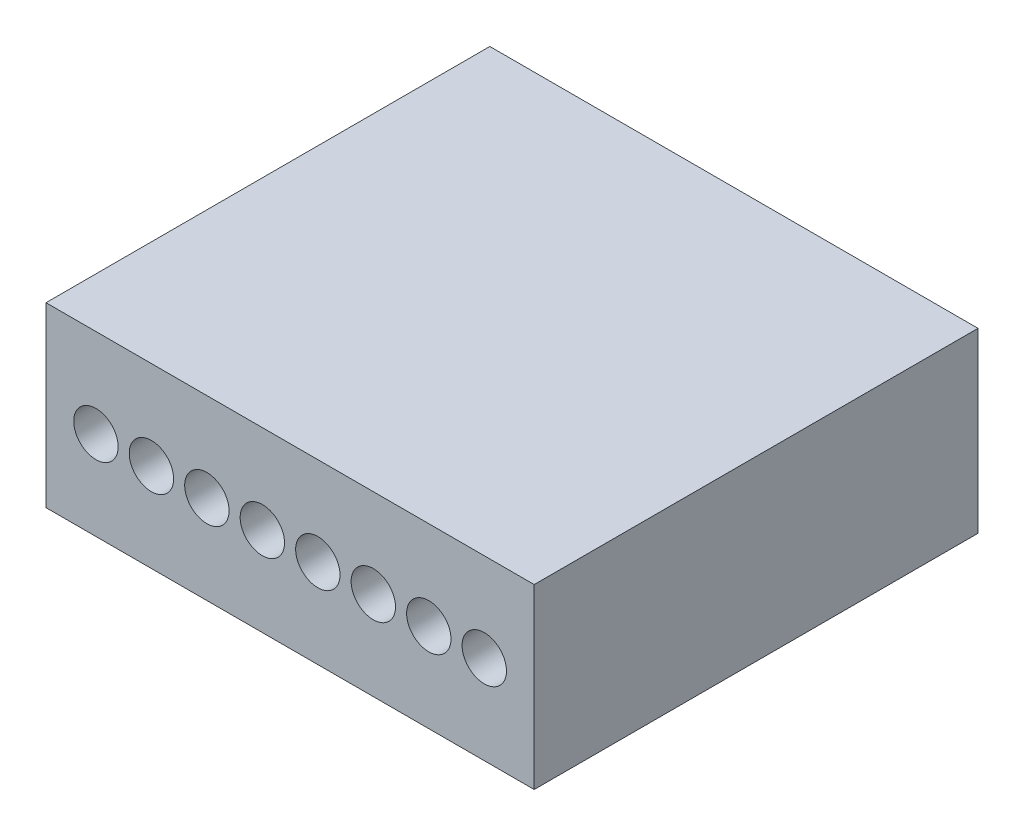
ISO-10303-21;
HEADER;
FILE_DESCRIPTION(('STEP AP214'),'2;1');
FILE_NAME('part.step','',(''),(''),'','','');
FILE_SCHEMA(('AUTOMOTIVE_DESIGN { 1 0 10303 214 1 1 1 1 }'));
ENDSEC;
DATA;
#1=APPLICATION_CONTEXT('core data for automotive mechanical design processes');
#2=APPLICATION_PROTOCOL_DEFINITION('international standard','automotive_design',2000,#1);
#3=PRODUCT_CONTEXT('',#1,'mechanical');
#4=PRODUCT('Part','Part','',(#3));
#5=PRODUCT_RELATED_PRODUCT_CATEGORY('part','',(#4));
#6=PRODUCT_DEFINITION_FORMATION('','',#4);
#7=PRODUCT_DEFINITION_CONTEXT('part definition',#1,'design');
#8=PRODUCT_DEFINITION('design','',#6,#7);
#9=PRODUCT_DEFINITION_SHAPE('','',#8);
#10=(LENGTH_UNIT() NAMED_UNIT(*) SI_UNIT(.MILLI.,.METRE.));
#11=(NAMED_UNIT(*) PLANE_ANGLE_UNIT() SI_UNIT($,.RADIAN.));
#12=(NAMED_UNIT(*) SI_UNIT($,.STERADIAN.) SOLID_ANGLE_UNIT());
#13=UNCERTAINTY_MEASURE_WITH_UNIT(LENGTH_MEASURE(1.E-05),#10,'distance_accuracy_value','');
#14=(GEOMETRIC_REPRESENTATION_CONTEXT(3) GLOBAL_UNCERTAINTY_ASSIGNED_CONTEXT((#13)) GLOBAL_UNIT_ASSIGNED_CONTEXT((#10,
#11,#12)) REPRESENTATION_CONTEXT('',''));
#15=CARTESIAN_POINT('',(0.,0.,0.));
#16=DIRECTION('',(0.,0.,1.));
#17=DIRECTION('',(1.,0.,0.));
#18=AXIS2_PLACEMENT_3D('',#15,#16,#17);
#19=CARTESIAN_POINT('',(0.,0.,10.));
#20=DIRECTION('',(1.,0.,0.));
#21=DIRECTION('',(0.,0.,-1.));
#22=AXIS2_PLACEMENT_3D('',#19,#20,#21);
#23=PLANE('',#22);
#24=DIRECTION('',(0.,-1.,0.));
#25=VECTOR('',#24,1.);
#26=CARTESIAN_POINT('',(0.,0.,0.));
#27=LINE('',#26,#25);
#28=CARTESIAN_POINT('',(0.,4.,0.));
#29=VERTEX_POINT('',#28);
#30=CARTESIAN_POINT('',(0.,0.,0.));
#31=VERTEX_POINT('',#30);
#32=EDGE_CURVE('E107',#29,#31,#27,.T.);
#33=ORIENTED_EDGE('',*,*,#32,.T.);
#34=DIRECTION('',(0.,0.,-1.));
#35=VECTOR('',#34,1.);
#36=CARTESIAN_POINT('',(0.,0.,10.));
#37=LINE('',#36,#35);
#38=CARTESIAN_POINT('',(0.,0.,10.));
#39=VERTEX_POINT('',#38);
#40=EDGE_CURVE('E11',#39,#31,#37,.T.);
#41=ORIENTED_EDGE('',*,*,#40,.F.);
#42=DIRECTION('',(0.,-1.,0.));
#43=VECTOR('',#42,1.);
#44=CARTESIAN_POINT('',(0.,0.,10.));
#45=LINE('',#44,#43);
#46=CARTESIAN_POINT('',(0.,4.,10.));
#47=VERTEX_POINT('',#46);
#48=EDGE_CURVE('E91',#47,#39,#45,.T.);
#49=ORIENTED_EDGE('',*,*,#48,.F.);
#50=DIRECTION('',(0.,0.,-1.));
#51=VECTOR('',#50,1.);
#52=CARTESIAN_POINT('',(0.,4.,10.));
#53=LINE('',#52,#51);
#54=EDGE_CURVE('E103',#47,#29,#53,.T.);
#55=ORIENTED_EDGE('',*,*,#54,.T.);
#56=EDGE_LOOP('',(#33,#41,#49,#55));
#57=FACE_BOUND('',#56,.T.);
#58=ADVANCED_FACE('F39',(#57),#23,.F.);
#59=CARTESIAN_POINT('',(0.,0.,10.));
#60=DIRECTION('',(0.,1.,0.));
#61=DIRECTION('',(0.,0.,1.));
#62=AXIS2_PLACEMENT_3D('',#59,#60,#61);
#63=PLANE('',#62);
#64=DIRECTION('',(1.,0.,0.));
#65=VECTOR('',#64,1.);
#66=CARTESIAN_POINT('',(0.,0.,0.));
#67=LINE('',#66,#65);
#68=CARTESIAN_POINT('',(11.,0.,0.));
#69=VERTEX_POINT('',#68);
#70=EDGE_CURVE('E96',#31,#69,#67,.T.);
#71=ORIENTED_EDGE('',*,*,#70,.T.);
#72=DIRECTION('',(0.,0.,-1.));
#73=VECTOR('',#72,1.);
#74=CARTESIAN_POINT('',(11.,0.,10.));
#75=LINE('',#74,#73);
#76=CARTESIAN_POINT('',(11.,0.,10.));
#77=VERTEX_POINT('',#76);
#78=EDGE_CURVE('E48',#77,#69,#75,.T.);
#79=ORIENTED_EDGE('',*,*,#78,.F.);
#80=DIRECTION('',(1.,0.,0.));
#81=VECTOR('',#80,1.);
#82=CARTESIAN_POINT('',(0.,0.,10.));
#83=LINE('',#82,#81);
#84=EDGE_CURVE('E86',#39,#77,#83,.T.);
#85=ORIENTED_EDGE('',*,*,#84,.F.);
#86=ORIENTED_EDGE('',*,*,#40,.T.);
#87=EDGE_LOOP('',(#71,#79,#85,#86));
#88=FACE_BOUND('',#87,.T.);
#89=ADVANCED_FACE('F95',(#88),#63,.F.);
#90=CARTESIAN_POINT('',(11.,0.,10.));
#91=DIRECTION('',(-1.,0.,0.));
#92=DIRECTION('',(0.,0.,1.));
#93=AXIS2_PLACEMENT_3D('',#90,#91,#92);
#94=PLANE('',#93);
#95=DIRECTION('',(0.,1.,0.));
#96=VECTOR('',#95,1.);
#97=CARTESIAN_POINT('',(11.,0.,0.));
#98=LINE('',#97,#96);
#99=CARTESIAN_POINT('',(11.,4.,0.));
#100=VERTEX_POINT('',#99);
#101=EDGE_CURVE('E73',#69,#100,#98,.T.);
#102=ORIENTED_EDGE('',*,*,#101,.T.);
#103=DIRECTION('',(0.,0.,-1.));
#104=VECTOR('',#103,1.);
#105=CARTESIAN_POINT('',(11.,4.,10.));
#106=LINE('',#105,#104);
#107=CARTESIAN_POINT('',(11.,4.,10.));
#108=VERTEX_POINT('',#107);
#109=EDGE_CURVE('E98',#108,#100,#106,.T.);
#110=ORIENTED_EDGE('',*,*,#109,.F.);
#111=DIRECTION('',(0.,1.,0.));
#112=VECTOR('',#111,1.);
#113=CARTESIAN_POINT('',(11.,0.,10.));
#114=LINE('',#113,#112);
#115=EDGE_CURVE('E89',#77,#108,#114,.T.);
#116=ORIENTED_EDGE('',*,*,#115,.F.);
#117=ORIENTED_EDGE('',*,*,#78,.T.);
#118=EDGE_LOOP('',(#102,#110,#116,#117));
#119=FACE_BOUND('',#118,.T.);
#120=ADVANCED_FACE('F99',(#119),#94,.F.);
#121=CARTESIAN_POINT('',(0.,4.,10.));
#122=DIRECTION('',(0.,-1.,0.));
#123=DIRECTION('',(0.,0.,-1.));
#124=AXIS2_PLACEMENT_3D('',#121,#122,#123);
#125=PLANE('',#124);
#126=DIRECTION('',(-1.,0.,0.));
#127=VECTOR('',#126,1.);
#128=CARTESIAN_POINT('',(0.,4.,0.));
#129=LINE('',#128,#127);
#130=EDGE_CURVE('E79',#100,#29,#129,.T.);
#131=ORIENTED_EDGE('',*,*,#130,.T.);
#132=ORIENTED_EDGE('',*,*,#54,.F.);
#133=DIRECTION('',(-1.,0.,0.));
#134=VECTOR('',#133,1.);
#135=CARTESIAN_POINT('',(0.,4.,10.));
#136=LINE('',#135,#134);
#137=EDGE_CURVE('E56',#108,#47,#136,.T.);
#138=ORIENTED_EDGE('',*,*,#137,.F.);
#139=ORIENTED_EDGE('',*,*,#109,.T.);
#140=EDGE_LOOP('',(#131,#132,#138,#139));
#141=FACE_BOUND('',#140,.T.);
#142=ADVANCED_FACE('F121',(#141),#125,.F.);
#143=CARTESIAN_POINT('',(0.,0.,10.));
#144=DIRECTION('',(0.,0.,-1.));
#145=DIRECTION('',(-1.,0.,0.));
#146=AXIS2_PLACEMENT_3D('',#143,#144,#145);
#147=PLANE('',#146);
#148=CARTESIAN_POINT('',(1.125,2.,10.));
#149=DIRECTION('',(0.,0.,1.));
#150=DIRECTION('',(1.,0.,0.));
#151=AXIS2_PLACEMENT_3D('',#148,#149,#150);
#152=CIRCLE('',#151,0.5);
#153=CARTESIAN_POINT('',(1.625,2.,10.));
#154=VERTEX_POINT('',#153);
#155=EDGE_CURVE('E184',#154,#154,#152,.T.);
#156=ORIENTED_EDGE('',*,*,#155,.F.);
#157=EDGE_LOOP('',(#156));
#158=FACE_BOUND('',#157,.T.);
#159=CARTESIAN_POINT('',(2.375,2.,10.));
#160=DIRECTION('',(0.,0.,1.));
#161=DIRECTION('',(1.,0.,0.));
#162=AXIS2_PLACEMENT_3D('',#159,#160,#161);
#163=CIRCLE('',#162,0.5);
#164=CARTESIAN_POINT('',(2.875,2.,10.));
#165=VERTEX_POINT('',#164);
#166=EDGE_CURVE('E176',#165,#165,#163,.T.);
#167=ORIENTED_EDGE('',*,*,#166,.F.);
#168=EDGE_LOOP('',(#167));
#169=FACE_BOUND('',#168,.T.);
#170=CARTESIAN_POINT('',(3.625,2.,10.));
#171=DIRECTION('',(0.,0.,1.));
#172=DIRECTION('',(1.,0.,0.));
#173=AXIS2_PLACEMENT_3D('',#170,#171,#172);
#174=CIRCLE('',#173,0.5);
#175=CARTESIAN_POINT('',(4.125,2.,10.));
#176=VERTEX_POINT('',#175);
#177=EDGE_CURVE('E168',#176,#176,#174,.T.);
#178=ORIENTED_EDGE('',*,*,#177,.F.);
#179=EDGE_LOOP('',(#178));
#180=FACE_BOUND('',#179,.T.);
#181=CARTESIAN_POINT('',(4.875,2.,10.));
#182=DIRECTION('',(0.,0.,1.));
#183=DIRECTION('',(1.,0.,0.));
#184=AXIS2_PLACEMENT_3D('',#181,#182,#183);
#185=CIRCLE('',#184,0.5);
#186=CARTESIAN_POINT('',(5.375,2.,10.));
#187=VERTEX_POINT('',#186);
#188=EDGE_CURVE('E160',#187,#187,#185,.T.);
#189=ORIENTED_EDGE('',*,*,#188,.F.);
#190=EDGE_LOOP('',(#189));
#191=FACE_BOUND('',#190,.T.);
#192=CARTESIAN_POINT('',(6.125,2.,10.));
#193=DIRECTION('',(0.,0.,1.));
#194=DIRECTION('',(1.,0.,0.));
#195=AXIS2_PLACEMENT_3D('',#192,#193,#194);
#196=CIRCLE('',#195,0.5);
#197=CARTESIAN_POINT('',(6.625,2.,10.));
#198=VERTEX_POINT('',#197);
#199=EDGE_CURVE('E152',#198,#198,#196,.T.);
#200=ORIENTED_EDGE('',*,*,#199,.F.);
#201=EDGE_LOOP('',(#200));
#202=FACE_BOUND('',#201,.T.);
#203=CARTESIAN_POINT('',(7.375,2.,10.));
#204=DIRECTION('',(0.,0.,1.));
#205=DIRECTION('',(1.,0.,0.));
#206=AXIS2_PLACEMENT_3D('',#203,#204,#205);
#207=CIRCLE('',#206,0.500000000000002);
#208=CARTESIAN_POINT('',(7.875,2.,10.));
#209=VERTEX_POINT('',#208);
#210=EDGE_CURVE('E144',#209,#209,#207,.T.);
#211=ORIENTED_EDGE('',*,*,#210,.F.);
#212=EDGE_LOOP('',(#211));
#213=FACE_BOUND('',#212,.T.);
#214=CARTESIAN_POINT('',(8.625,2.,10.));
#215=DIRECTION('',(0.,0.,1.));
#216=DIRECTION('',(1.,0.,0.));
#217=AXIS2_PLACEMENT_3D('',#214,#215,#216);
#218=CIRCLE('',#217,0.499999999999999);
#219=CARTESIAN_POINT('',(9.125,2.,10.));
#220=VERTEX_POINT('',#219);
#221=EDGE_CURVE('E136',#220,#220,#218,.T.);
#222=ORIENTED_EDGE('',*,*,#221,.F.);
#223=EDGE_LOOP('',(#222));
#224=FACE_BOUND('',#223,.T.);
#225=CARTESIAN_POINT('',(9.875,2.,10.));
#226=DIRECTION('',(0.,0.,1.));
#227=DIRECTION('',(1.,0.,0.));
#228=AXIS2_PLACEMENT_3D('',#225,#226,#227);
#229=CIRCLE('',#228,0.499999999999999);
#230=CARTESIAN_POINT('',(10.375,2.,10.));
#231=VERTEX_POINT('',#230);
#232=EDGE_CURVE('E128',#231,#231,#229,.T.);
#233=ORIENTED_EDGE('',*,*,#232,.F.);
#234=EDGE_LOOP('',(#233));
#235=FACE_BOUND('',#234,.T.);
#236=ORIENTED_EDGE('',*,*,#48,.T.);
#237=ORIENTED_EDGE('',*,*,#84,.T.);
#238=ORIENTED_EDGE('',*,*,#115,.T.);
#239=ORIENTED_EDGE('',*,*,#137,.T.);
#240=EDGE_LOOP('',(#236,#237,#238,#239));
#241=FACE_BOUND('',#240,.T.);
#242=ADVANCED_FACE('F87',(#158,#169,#180,#191,#202,#213,#224,#235,#241),#147,.F.);
#243=CARTESIAN_POINT('',(0.,0.,0.));
#244=DIRECTION('',(0.,0.,-1.));
#245=DIRECTION('',(-1.,0.,0.));
#246=AXIS2_PLACEMENT_3D('',#243,#244,#245);
#247=PLANE('',#246);
#248=ORIENTED_EDGE('',*,*,#32,.F.);
#249=ORIENTED_EDGE('',*,*,#130,.F.);
#250=ORIENTED_EDGE('',*,*,#101,.F.);
#251=ORIENTED_EDGE('',*,*,#70,.F.);
#252=EDGE_LOOP('',(#248,#249,#250,#251));
#253=FACE_BOUND('',#252,.T.);
#254=ADVANCED_FACE('F124',(#253),#247,.T.);
#255=CARTESIAN_POINT('',(9.875,2.,5.));
#256=DIRECTION('',(0.,0.,1.));
#257=DIRECTION('',(1.,0.,0.));
#258=AXIS2_PLACEMENT_3D('',#255,#256,#257);
#259=CYLINDRICAL_SURFACE('',#258,0.499999999999999);
#260=CARTESIAN_POINT('',(9.875,2.,5.));
#261=DIRECTION('',(0.,0.,1.));
#262=DIRECTION('',(1.,0.,0.));
#263=AXIS2_PLACEMENT_3D('',#260,#261,#262);
#264=CIRCLE('',#263,0.499999999999999);
#265=CARTESIAN_POINT('',(10.375,2.,5.));
#266=VERTEX_POINT('',#265);
#267=EDGE_CURVE('E132',#266,#266,#264,.T.);
#268=ORIENTED_EDGE('',*,*,#267,.F.);
#269=EDGE_LOOP('',(#268));
#270=FACE_BOUND('',#269,.T.);
#271=ORIENTED_EDGE('',*,*,#232,.T.);
#272=EDGE_LOOP('',(#271));
#273=FACE_BOUND('',#272,.T.);
#274=ADVANCED_FACE('F218',(#270,#273),#259,.F.);
#275=CARTESIAN_POINT('',(9.875,2.,5.));
#276=DIRECTION('',(0.,0.,1.));
#277=DIRECTION('',(1.,0.,0.));
#278=AXIS2_PLACEMENT_3D('',#275,#276,#277);
#279=PLANE('',#278);
#280=ORIENTED_EDGE('',*,*,#267,.T.);
#281=EDGE_LOOP('',(#280));
#282=FACE_BOUND('',#281,.T.);
#283=ADVANCED_FACE('F220',(#282),#279,.T.);
#284=CARTESIAN_POINT('',(8.625,2.,5.));
#285=DIRECTION('',(0.,0.,1.));
#286=DIRECTION('',(1.,0.,0.));
#287=AXIS2_PLACEMENT_3D('',#284,#285,#286);
#288=CYLINDRICAL_SURFACE('',#287,0.499999999999999);
#289=CARTESIAN_POINT('',(8.625,2.,5.));
#290=DIRECTION('',(0.,0.,1.));
#291=DIRECTION('',(1.,0.,0.));
#292=AXIS2_PLACEMENT_3D('',#289,#290,#291);
#293=CIRCLE('',#292,0.499999999999999);
#294=CARTESIAN_POINT('',(9.125,2.,5.));
#295=VERTEX_POINT('',#294);
#296=EDGE_CURVE('E140',#295,#295,#293,.T.);
#297=ORIENTED_EDGE('',*,*,#296,.F.);
#298=EDGE_LOOP('',(#297));
#299=FACE_BOUND('',#298,.T.);
#300=ORIENTED_EDGE('',*,*,#221,.T.);
#301=EDGE_LOOP('',(#300));
#302=FACE_BOUND('',#301,.T.);
#303=ADVANCED_FACE('F227',(#299,#302),#288,.F.);
#304=CARTESIAN_POINT('',(8.625,2.,5.));
#305=DIRECTION('',(0.,0.,1.));
#306=DIRECTION('',(1.,0.,0.));
#307=AXIS2_PLACEMENT_3D('',#304,#305,#306);
#308=PLANE('',#307);
#309=ORIENTED_EDGE('',*,*,#296,.T.);
#310=EDGE_LOOP('',(#309));
#311=FACE_BOUND('',#310,.T.);
#312=ADVANCED_FACE('F275',(#311),#308,.T.);
#313=CARTESIAN_POINT('',(7.375,2.,5.));
#314=DIRECTION('',(0.,0.,1.));
#315=DIRECTION('',(1.,0.,0.));
#316=AXIS2_PLACEMENT_3D('',#313,#314,#315);
#317=CYLINDRICAL_SURFACE('',#316,0.500000000000002);
#318=CARTESIAN_POINT('',(7.375,2.,5.));
#319=DIRECTION('',(0.,0.,1.));
#320=DIRECTION('',(1.,0.,0.));
#321=AXIS2_PLACEMENT_3D('',#318,#319,#320);
#322=CIRCLE('',#321,0.500000000000002);
#323=CARTESIAN_POINT('',(7.875,2.,5.));
#324=VERTEX_POINT('',#323);
#325=EDGE_CURVE('E148',#324,#324,#322,.T.);
#326=ORIENTED_EDGE('',*,*,#325,.F.);
#327=EDGE_LOOP('',(#326));
#328=FACE_BOUND('',#327,.T.);
#329=ORIENTED_EDGE('',*,*,#210,.T.);
#330=EDGE_LOOP('',(#329));
#331=FACE_BOUND('',#330,.T.);
#332=ADVANCED_FACE('F284',(#328,#331),#317,.F.);
#333=CARTESIAN_POINT('',(7.375,2.,5.));
#334=DIRECTION('',(0.,0.,1.));
#335=DIRECTION('',(1.,0.,0.));
#336=AXIS2_PLACEMENT_3D('',#333,#334,#335);
#337=PLANE('',#336);
#338=ORIENTED_EDGE('',*,*,#325,.T.);
#339=EDGE_LOOP('',(#338));
#340=FACE_BOUND('',#339,.T.);
#341=ADVANCED_FACE('F293',(#340),#337,.T.);
#342=CARTESIAN_POINT('',(6.125,2.,5.));
#343=DIRECTION('',(0.,0.,1.));
#344=DIRECTION('',(1.,0.,0.));
#345=AXIS2_PLACEMENT_3D('',#342,#343,#344);
#346=CYLINDRICAL_SURFACE('',#345,0.5);
#347=CARTESIAN_POINT('',(6.125,2.,5.));
#348=DIRECTION('',(0.,0.,1.));
#349=DIRECTION('',(1.,0.,0.));
#350=AXIS2_PLACEMENT_3D('',#347,#348,#349);
#351=CIRCLE('',#350,0.5);
#352=CARTESIAN_POINT('',(6.625,2.,5.));
#353=VERTEX_POINT('',#352);
#354=EDGE_CURVE('E156',#353,#353,#351,.T.);
#355=ORIENTED_EDGE('',*,*,#354,.F.);
#356=EDGE_LOOP('',(#355));
#357=FACE_BOUND('',#356,.T.);
#358=ORIENTED_EDGE('',*,*,#199,.T.);
#359=EDGE_LOOP('',(#358));
#360=FACE_BOUND('',#359,.T.);
#361=ADVANCED_FACE('F302',(#357,#360),#346,.F.);
#362=CARTESIAN_POINT('',(6.125,2.,5.));
#363=DIRECTION('',(0.,0.,1.));
#364=DIRECTION('',(1.,0.,0.));
#365=AXIS2_PLACEMENT_3D('',#362,#363,#364);
#366=PLANE('',#365);
#367=ORIENTED_EDGE('',*,*,#354,.T.);
#368=EDGE_LOOP('',(#367));
#369=FACE_BOUND('',#368,.T.);
#370=ADVANCED_FACE('F311',(#369),#366,.T.);
#371=CARTESIAN_POINT('',(4.875,2.,5.));
#372=DIRECTION('',(0.,0.,1.));
#373=DIRECTION('',(1.,0.,0.));
#374=AXIS2_PLACEMENT_3D('',#371,#372,#373);
#375=CYLINDRICAL_SURFACE('',#374,0.5);
#376=CARTESIAN_POINT('',(4.875,2.,5.));
#377=DIRECTION('',(0.,0.,1.));
#378=DIRECTION('',(1.,0.,0.));
#379=AXIS2_PLACEMENT_3D('',#376,#377,#378);
#380=CIRCLE('',#379,0.5);
#381=CARTESIAN_POINT('',(5.375,2.,5.));
#382=VERTEX_POINT('',#381);
#383=EDGE_CURVE('E164',#382,#382,#380,.T.);
#384=ORIENTED_EDGE('',*,*,#383,.F.);
#385=EDGE_LOOP('',(#384));
#386=FACE_BOUND('',#385,.T.);
#387=ORIENTED_EDGE('',*,*,#188,.T.);
#388=EDGE_LOOP('',(#387));
#389=FACE_BOUND('',#388,.T.);
#390=ADVANCED_FACE('F320',(#386,#389),#375,.F.);
#391=CARTESIAN_POINT('',(4.875,2.,5.));
#392=DIRECTION('',(0.,0.,1.));
#393=DIRECTION('',(1.,0.,0.));
#394=AXIS2_PLACEMENT_3D('',#391,#392,#393);
#395=PLANE('',#394);
#396=ORIENTED_EDGE('',*,*,#383,.T.);
#397=EDGE_LOOP('',(#396));
#398=FACE_BOUND('',#397,.T.);
#399=ADVANCED_FACE('F329',(#398),#395,.T.);
#400=CARTESIAN_POINT('',(3.625,2.,5.));
#401=DIRECTION('',(0.,0.,1.));
#402=DIRECTION('',(1.,0.,0.));
#403=AXIS2_PLACEMENT_3D('',#400,#401,#402);
#404=CYLINDRICAL_SURFACE('',#403,0.5);
#405=CARTESIAN_POINT('',(3.625,2.,5.));
#406=DIRECTION('',(0.,0.,1.));
#407=DIRECTION('',(1.,0.,0.));
#408=AXIS2_PLACEMENT_3D('',#405,#406,#407);
#409=CIRCLE('',#408,0.5);
#410=CARTESIAN_POINT('',(4.125,2.,5.));
#411=VERTEX_POINT('',#410);
#412=EDGE_CURVE('E172',#411,#411,#409,.T.);
#413=ORIENTED_EDGE('',*,*,#412,.F.);
#414=EDGE_LOOP('',(#413));
#415=FACE_BOUND('',#414,.T.);
#416=ORIENTED_EDGE('',*,*,#177,.T.);
#417=EDGE_LOOP('',(#416));
#418=FACE_BOUND('',#417,.T.);
#419=ADVANCED_FACE('F338',(#415,#418),#404,.F.);
#420=CARTESIAN_POINT('',(3.625,2.,5.));
#421=DIRECTION('',(0.,0.,1.));
#422=DIRECTION('',(1.,0.,0.));
#423=AXIS2_PLACEMENT_3D('',#420,#421,#422);
#424=PLANE('',#423);
#425=ORIENTED_EDGE('',*,*,#412,.T.);
#426=EDGE_LOOP('',(#425));
#427=FACE_BOUND('',#426,.T.);
#428=ADVANCED_FACE('F347',(#427),#424,.T.);
#429=CARTESIAN_POINT('',(2.375,2.,5.));
#430=DIRECTION('',(0.,0.,1.));
#431=DIRECTION('',(1.,0.,0.));
#432=AXIS2_PLACEMENT_3D('',#429,#430,#431);
#433=CYLINDRICAL_SURFACE('',#432,0.5);
#434=CARTESIAN_POINT('',(2.375,2.,5.));
#435=DIRECTION('',(0.,0.,1.));
#436=DIRECTION('',(1.,0.,0.));
#437=AXIS2_PLACEMENT_3D('',#434,#435,#436);
#438=CIRCLE('',#437,0.5);
#439=CARTESIAN_POINT('',(2.875,2.,5.));
#440=VERTEX_POINT('',#439);
#441=EDGE_CURVE('E180',#440,#440,#438,.T.);
#442=ORIENTED_EDGE('',*,*,#441,.F.);
#443=EDGE_LOOP('',(#442));
#444=FACE_BOUND('',#443,.T.);
#445=ORIENTED_EDGE('',*,*,#166,.T.);
#446=EDGE_LOOP('',(#445));
#447=FACE_BOUND('',#446,.T.);
#448=ADVANCED_FACE('F356',(#444,#447),#433,.F.);
#449=CARTESIAN_POINT('',(2.375,2.,5.));
#450=DIRECTION('',(0.,0.,1.));
#451=DIRECTION('',(1.,0.,0.));
#452=AXIS2_PLACEMENT_3D('',#449,#450,#451);
#453=PLANE('',#452);
#454=ORIENTED_EDGE('',*,*,#441,.T.);
#455=EDGE_LOOP('',(#454));
#456=FACE_BOUND('',#455,.T.);
#457=ADVANCED_FACE('F197',(#456),#453,.T.);
#458=CARTESIAN_POINT('',(1.125,2.,5.));
#459=DIRECTION('',(0.,0.,1.));
#460=DIRECTION('',(1.,0.,0.));
#461=AXIS2_PLACEMENT_3D('',#458,#459,#460);
#462=CYLINDRICAL_SURFACE('',#461,0.5);
#463=CARTESIAN_POINT('',(1.125,2.,5.));
#464=DIRECTION('',(0.,0.,1.));
#465=DIRECTION('',(1.,0.,0.));
#466=AXIS2_PLACEMENT_3D('',#463,#464,#465);
#467=CIRCLE('',#466,0.5);
#468=CARTESIAN_POINT('',(1.625,2.,5.));
#469=VERTEX_POINT('',#468);
#470=EDGE_CURVE('E111',#469,#469,#467,.T.);
#471=ORIENTED_EDGE('',*,*,#470,.F.);
#472=EDGE_LOOP('',(#471));
#473=FACE_BOUND('',#472,.T.);
#474=ORIENTED_EDGE('',*,*,#155,.T.);
#475=EDGE_LOOP('',(#474));
#476=FACE_BOUND('',#475,.T.);
#477=ADVANCED_FACE('F194',(#473,#476),#462,.F.);
#478=CARTESIAN_POINT('',(1.125,2.,5.));
#479=DIRECTION('',(0.,0.,1.));
#480=DIRECTION('',(1.,0.,0.));
#481=AXIS2_PLACEMENT_3D('',#478,#479,#480);
#482=PLANE('',#481);
#483=ORIENTED_EDGE('',*,*,#470,.T.);
#484=EDGE_LOOP('',(#483));
#485=FACE_BOUND('',#484,.T.);
#486=ADVANCED_FACE('F192',(#485),#482,.T.);
#487=CLOSED_SHELL('',(#58,#89,#120,#142,#242,#254,#274,#283,#303,#312,#332,#341,#361,#370,#390,
#399,#419,#428,#448,#457,#477,#486));
#488=MANIFOLD_SOLID_BREP('B2',#487);
#489=ADVANCED_BREP_SHAPE_REPRESENTATION('',(#18,#488),#14);
#490=SHAPE_DEFINITION_REPRESENTATION(#9,#489);
ENDSEC;
END-ISO-10303-21;
